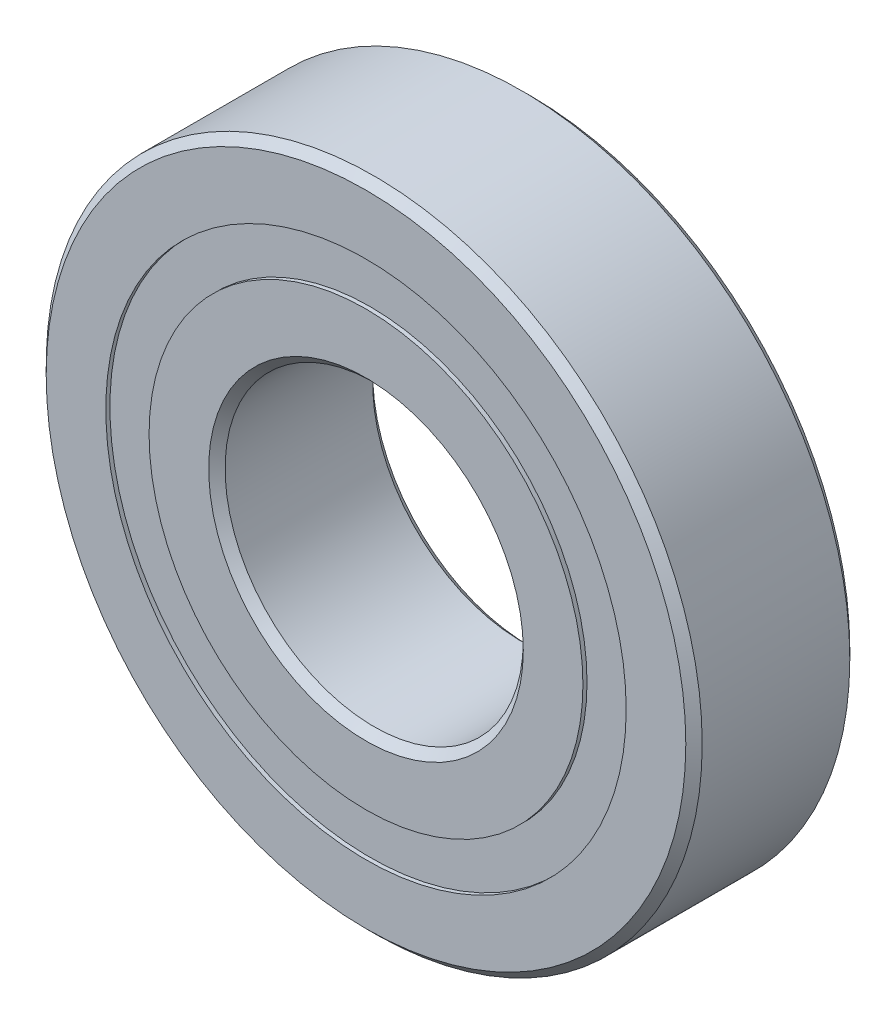
ISO-10303-21;
HEADER;
FILE_DESCRIPTION(('STEP AP214'),'2;1');
FILE_NAME('part.step','',(''),(''),'','','');
FILE_SCHEMA(('AUTOMOTIVE_DESIGN { 1 0 10303 214 1 1 1 1 }'));
ENDSEC;
DATA;
#1=APPLICATION_CONTEXT('core data for automotive mechanical design processes');
#2=APPLICATION_PROTOCOL_DEFINITION('international standard','automotive_design',2000,#1);
#3=PRODUCT_CONTEXT('',#1,'mechanical');
#4=PRODUCT('Part','Part','',(#3));
#5=PRODUCT_RELATED_PRODUCT_CATEGORY('part','',(#4));
#6=PRODUCT_DEFINITION_FORMATION('','',#4);
#7=PRODUCT_DEFINITION_CONTEXT('part definition',#1,'design');
#8=PRODUCT_DEFINITION('design','',#6,#7);
#9=PRODUCT_DEFINITION_SHAPE('','',#8);
#10=(LENGTH_UNIT() NAMED_UNIT(*) SI_UNIT(.MILLI.,.METRE.));
#11=(NAMED_UNIT(*) PLANE_ANGLE_UNIT() SI_UNIT($,.RADIAN.));
#12=(NAMED_UNIT(*) SI_UNIT($,.STERADIAN.) SOLID_ANGLE_UNIT());
#13=UNCERTAINTY_MEASURE_WITH_UNIT(LENGTH_MEASURE(1.E-05),#10,'distance_accuracy_value','');
#14=(GEOMETRIC_REPRESENTATION_CONTEXT(3) GLOBAL_UNCERTAINTY_ASSIGNED_CONTEXT((#13)) GLOBAL_UNIT_ASSIGNED_CONTEXT((#10,
#11,#12)) REPRESENTATION_CONTEXT('',''));
#15=CARTESIAN_POINT('',(0.,0.,0.));
#16=DIRECTION('',(0.,0.,1.));
#17=DIRECTION('',(1.,0.,0.));
#18=AXIS2_PLACEMENT_3D('',#15,#16,#17);
#19=CARTESIAN_POINT('',(0.,13.8513736263736,-4.14734375));
#20=DIRECTION('',(0.,0.,1.));
#21=DIRECTION('',(1.,0.,0.));
#22=AXIS2_PLACEMENT_3D('',#19,#20,#21);
#23=PLANE('',#22);
#24=CARTESIAN_POINT('',(0.,0.,-4.14734375));
#25=DIRECTION('',(0.,0.,1.));
#26=DIRECTION('',(1.,0.,0.));
#27=AXIS2_PLACEMENT_3D('',#24,#25,#26);
#28=CIRCLE('',#27,13.8513736263736);
#29=CARTESIAN_POINT('',(13.8513736263736,0.,-4.14734375));
#30=VERTEX_POINT('',#29);
#31=EDGE_CURVE('E72',#30,#30,#28,.T.);
#32=ORIENTED_EDGE('',*,*,#31,.F.);
#33=EDGE_LOOP('',(#32));
#34=FACE_BOUND('',#33,.T.);
#35=CARTESIAN_POINT('',(0.,0.,-4.14734375));
#36=DIRECTION('',(0.,0.,1.));
#37=DIRECTION('',(1.,0.,0.));
#38=AXIS2_PLACEMENT_3D('',#35,#36,#37);
#39=CIRCLE('',#38,11.5486263736264);
#40=CARTESIAN_POINT('',(11.5486263736264,0.,-4.14734375));
#41=VERTEX_POINT('',#40);
#42=EDGE_CURVE('E11',#41,#41,#39,.T.);
#43=ORIENTED_EDGE('',*,*,#42,.T.);
#44=EDGE_LOOP('',(#43));
#45=FACE_BOUND('',#44,.T.);
#46=ADVANCED_FACE('F58',(#34,#45),#23,.F.);
#47=CARTESIAN_POINT('',(0.,0.,4.365625));
#48=DIRECTION('',(0.,0.,1.));
#49=DIRECTION('',(1.,0.,0.));
#50=AXIS2_PLACEMENT_3D('',#47,#48,#49);
#51=CYLINDRICAL_SURFACE('',#50,11.5486263736264);
#52=ORIENTED_EDGE('',*,*,#42,.F.);
#53=EDGE_LOOP('',(#52));
#54=FACE_BOUND('',#53,.T.);
#55=CARTESIAN_POINT('',(0.,0.,-2.25617798111032));
#56=DIRECTION('',(0.,0.,1.));
#57=DIRECTION('',(1.,0.,0.));
#58=AXIS2_PLACEMENT_3D('',#55,#56,#57);
#59=CIRCLE('',#58,11.5486263736264);
#60=CARTESIAN_POINT('',(11.5486263736264,0.,-2.25617798111032));
#61=VERTEX_POINT('',#60);
#62=EDGE_CURVE('E64',#61,#61,#59,.T.);
#63=ORIENTED_EDGE('',*,*,#62,.T.);
#64=EDGE_LOOP('',(#63));
#65=FACE_BOUND('',#64,.T.);
#66=ADVANCED_FACE('F81',(#54,#65),#51,.F.);
#67=CARTESIAN_POINT('',(0.,13.8513736263736,-2.25617798111032));
#68=DIRECTION('',(0.,0.,-1.));
#69=DIRECTION('',(-1.,0.,0.));
#70=AXIS2_PLACEMENT_3D('',#67,#68,#69);
#71=PLANE('',#70);
#72=ORIENTED_EDGE('',*,*,#62,.F.);
#73=EDGE_LOOP('',(#72));
#74=FACE_BOUND('',#73,.T.);
#75=CARTESIAN_POINT('',(0.,0.,-2.25617798111032));
#76=DIRECTION('',(0.,0.,1.));
#77=DIRECTION('',(1.,0.,0.));
#78=AXIS2_PLACEMENT_3D('',#75,#76,#77);
#79=CIRCLE('',#78,13.8513736263736);
#80=CARTESIAN_POINT('',(13.8513736263736,0.,-2.25617798111032));
#81=VERTEX_POINT('',#80);
#82=EDGE_CURVE('E68',#81,#81,#79,.T.);
#83=ORIENTED_EDGE('',*,*,#82,.T.);
#84=EDGE_LOOP('',(#83));
#85=FACE_BOUND('',#84,.T.);
#86=ADVANCED_FACE('F85',(#74,#85),#71,.F.);
#87=CARTESIAN_POINT('',(0.,0.,4.365625));
#88=DIRECTION('',(0.,0.,1.));
#89=DIRECTION('',(1.,0.,0.));
#90=AXIS2_PLACEMENT_3D('',#87,#88,#89);
#91=CYLINDRICAL_SURFACE('',#90,13.8513736263736);
#92=ORIENTED_EDGE('',*,*,#82,.F.);
#93=EDGE_LOOP('',(#92));
#94=FACE_BOUND('',#93,.T.);
#95=ORIENTED_EDGE('',*,*,#31,.T.);
#96=EDGE_LOOP('',(#95));
#97=FACE_BOUND('',#96,.T.);
#98=ADVANCED_FACE('F78',(#94,#97),#91,.T.);
#99=CLOSED_SHELL('',(#46,#66,#86,#98));
#100=MANIFOLD_SOLID_BREP('B2',#99);
#101=CARTESIAN_POINT('',(0.,13.8513736263736,4.14734375));
#102=DIRECTION('',(0.,0.,-1.));
#103=DIRECTION('',(-1.,0.,0.));
#104=AXIS2_PLACEMENT_3D('',#101,#102,#103);
#105=PLANE('',#104);
#106=CARTESIAN_POINT('',(0.,0.,4.14734375));
#107=DIRECTION('',(0.,0.,1.));
#108=DIRECTION('',(1.,0.,0.));
#109=AXIS2_PLACEMENT_3D('',#106,#107,#108);
#110=CIRCLE('',#109,11.5486263736264);
#111=CARTESIAN_POINT('',(11.5486263736264,0.,4.14734375));
#112=VERTEX_POINT('',#111);
#113=EDGE_CURVE('E57',#112,#112,#110,.T.);
#114=ORIENTED_EDGE('',*,*,#113,.F.);
#115=EDGE_LOOP('',(#114));
#116=FACE_BOUND('',#115,.T.);
#117=CARTESIAN_POINT('',(0.,0.,4.14734375));
#118=DIRECTION('',(0.,0.,1.));
#119=DIRECTION('',(1.,0.,0.));
#120=AXIS2_PLACEMENT_3D('',#117,#118,#119);
#121=CIRCLE('',#120,13.8513736263736);
#122=CARTESIAN_POINT('',(13.8513736263736,0.,4.14734375));
#123=VERTEX_POINT('',#122);
#124=EDGE_CURVE('E148',#123,#123,#121,.T.);
#125=ORIENTED_EDGE('',*,*,#124,.T.);
#126=EDGE_LOOP('',(#125));
#127=FACE_BOUND('',#126,.T.);
#128=ADVANCED_FACE('F134',(#116,#127),#105,.F.);
#129=CARTESIAN_POINT('',(0.,0.,4.365625));
#130=DIRECTION('',(0.,0.,1.));
#131=DIRECTION('',(1.,0.,0.));
#132=AXIS2_PLACEMENT_3D('',#129,#130,#131);
#133=CYLINDRICAL_SURFACE('',#132,11.5486263736264);
#134=CARTESIAN_POINT('',(0.,0.,2.25617798111032));
#135=DIRECTION('',(0.,0.,1.));
#136=DIRECTION('',(1.,0.,0.));
#137=AXIS2_PLACEMENT_3D('',#134,#135,#136);
#138=CIRCLE('',#137,11.5486263736264);
#139=CARTESIAN_POINT('',(11.5486263736264,0.,2.25617798111032));
#140=VERTEX_POINT('',#139);
#141=EDGE_CURVE('E140',#140,#140,#138,.T.);
#142=ORIENTED_EDGE('',*,*,#141,.F.);
#143=EDGE_LOOP('',(#142));
#144=FACE_BOUND('',#143,.T.);
#145=ORIENTED_EDGE('',*,*,#113,.T.);
#146=EDGE_LOOP('',(#145));
#147=FACE_BOUND('',#146,.T.);
#148=ADVANCED_FACE('F163',(#144,#147),#133,.F.);
#149=CARTESIAN_POINT('',(0.,13.8513736263736,2.25617798111032));
#150=DIRECTION('',(0.,0.,1.));
#151=DIRECTION('',(1.,0.,0.));
#152=AXIS2_PLACEMENT_3D('',#149,#150,#151);
#153=PLANE('',#152);
#154=CARTESIAN_POINT('',(0.,0.,2.25617798111032));
#155=DIRECTION('',(0.,0.,1.));
#156=DIRECTION('',(1.,0.,0.));
#157=AXIS2_PLACEMENT_3D('',#154,#155,#156);
#158=CIRCLE('',#157,13.8513736263736);
#159=CARTESIAN_POINT('',(13.8513736263736,0.,2.25617798111032));
#160=VERTEX_POINT('',#159);
#161=EDGE_CURVE('E144',#160,#160,#158,.T.);
#162=ORIENTED_EDGE('',*,*,#161,.F.);
#163=EDGE_LOOP('',(#162));
#164=FACE_BOUND('',#163,.T.);
#165=ORIENTED_EDGE('',*,*,#141,.T.);
#166=EDGE_LOOP('',(#165));
#167=FACE_BOUND('',#166,.T.);
#168=ADVANCED_FACE('F158',(#164,#167),#153,.F.);
#169=CARTESIAN_POINT('',(0.,0.,4.365625));
#170=DIRECTION('',(0.,0.,1.));
#171=DIRECTION('',(1.,0.,0.));
#172=AXIS2_PLACEMENT_3D('',#169,#170,#171);
#173=CYLINDRICAL_SURFACE('',#172,13.8513736263736);
#174=ORIENTED_EDGE('',*,*,#124,.F.);
#175=EDGE_LOOP('',(#174));
#176=FACE_BOUND('',#175,.T.);
#177=ORIENTED_EDGE('',*,*,#161,.T.);
#178=EDGE_LOOP('',(#177));
#179=FACE_BOUND('',#178,.T.);
#180=ADVANCED_FACE('F155',(#176,#179),#173,.T.);
#181=CLOSED_SHELL('',(#128,#148,#168,#180));
#182=MANIFOLD_SOLID_BREP('B6',#181);
#183=CARTESIAN_POINT('',(-7.46487270411427,10.2745158285619,0.));
#184=DIRECTION('',(0.,0.,1.));
#185=DIRECTION('',(-0.587785252292462,0.809016994374955,0.));
#186=AXIS2_PLACEMENT_3D('',#183,#184,#185);
#187=SPHERICAL_SURFACE('',#186,2.25617798111032);
#188=CARTESIAN_POINT('',(-7.46487270411427,10.2745158285619,2.25617798111032));
#189=VERTEX_POINT('',#188);
#190=VERTEX_LOOP('',#189);
#191=FACE_BOUND('',#190,.T.);
#192=ADVANCED_FACE('F210',(#191),#187,.T.);
#193=CLOSED_SHELL('',(#192));
#194=MANIFOLD_SOLID_BREP('B52',#193);
#195=CARTESIAN_POINT('',(-12.0784177569484,3.92451582856197,0.));
#196=DIRECTION('',(0.,0.,1.));
#197=DIRECTION('',(-0.95105651629515,0.309016994374958,0.));
#198=AXIS2_PLACEMENT_3D('',#195,#196,#197);
#199=SPHERICAL_SURFACE('',#198,2.25617798111032);
#200=CARTESIAN_POINT('',(-12.0784177569484,3.92451582856197,2.25617798111032));
#201=VERTEX_POINT('',#200);
#202=VERTEX_LOOP('',#201);
#203=FACE_BOUND('',#202,.T.);
#204=ADVANCED_FACE('F233',(#203),#199,.T.);
#205=CLOSED_SHELL('',(#204));
#206=MANIFOLD_SOLID_BREP('B130',#205);
#207=CARTESIAN_POINT('',(-12.0784177569485,-3.92451582856172,0.));
#208=DIRECTION('',(0.,0.,1.));
#209=DIRECTION('',(-0.951056516295157,-0.309016994374938,0.));
#210=AXIS2_PLACEMENT_3D('',#207,#208,#209);
#211=SPHERICAL_SURFACE('',#210,2.25617798111032);
#212=CARTESIAN_POINT('',(-12.0784177569485,-3.92451582856172,2.25617798111032));
#213=VERTEX_POINT('',#212);
#214=VERTEX_LOOP('',#213);
#215=FACE_BOUND('',#214,.T.);
#216=ADVANCED_FACE('F256',(#215),#211,.T.);
#217=CLOSED_SHELL('',(#216));
#218=MANIFOLD_SOLID_BREP('B206',#217);
#219=CARTESIAN_POINT('',(-7.4648727041145,-10.2745158285618,0.));
#220=DIRECTION('',(0.,0.,1.));
#221=DIRECTION('',(-0.58778525229248,-0.809016994374942,0.));
#222=AXIS2_PLACEMENT_3D('',#219,#220,#221);
#223=SPHERICAL_SURFACE('',#222,2.25617798111032);
#224=CARTESIAN_POINT('',(-7.4648727041145,-10.2745158285618,2.25617798111032));
#225=VERTEX_POINT('',#224);
#226=VERTEX_LOOP('',#225);
#227=FACE_BOUND('',#226,.T.);
#228=ADVANCED_FACE('F279',(#227),#223,.T.);
#229=CLOSED_SHELL('',(#228));
#230=MANIFOLD_SOLID_BREP('B229',#229);
#231=CARTESIAN_POINT('',(0.,-12.7,0.));
#232=DIRECTION('',(0.,0.,1.));
#233=DIRECTION('',(0.,-1.,0.));
#234=AXIS2_PLACEMENT_3D('',#231,#232,#233);
#235=SPHERICAL_SURFACE('',#234,2.25617798111032);
#236=CARTESIAN_POINT('',(0.,-12.7,2.25617798111032));
#237=VERTEX_POINT('',#236);
#238=VERTEX_LOOP('',#237);
#239=FACE_BOUND('',#238,.T.);
#240=ADVANCED_FACE('F302',(#239),#235,.T.);
#241=CLOSED_SHELL('',(#240));
#242=MANIFOLD_SOLID_BREP('B252',#241);
#243=CARTESIAN_POINT('',(7.46487270411435,-10.2745158285619,0.));
#244=DIRECTION('',(0.,0.,1.));
#245=DIRECTION('',(0.587785252292469,-0.809016994374951,0.));
#246=AXIS2_PLACEMENT_3D('',#243,#244,#245);
#247=SPHERICAL_SURFACE('',#246,2.25617798111032);
#248=CARTESIAN_POINT('',(7.46487270411435,-10.2745158285619,2.25617798111032));
#249=VERTEX_POINT('',#248);
#250=VERTEX_LOOP('',#249);
#251=FACE_BOUND('',#250,.T.);
#252=ADVANCED_FACE('F325',(#251),#247,.T.);
#253=CLOSED_SHELL('',(#252));
#254=MANIFOLD_SOLID_BREP('B275',#253);
#255=CARTESIAN_POINT('',(12.0784177569484,-3.92451582856189,0.));
#256=DIRECTION('',(0.,0.,1.));
#257=DIRECTION('',(0.951056516295152,-0.309016994374952,0.));
#258=AXIS2_PLACEMENT_3D('',#255,#256,#257);
#259=SPHERICAL_SURFACE('',#258,2.25617798111032);
#260=CARTESIAN_POINT('',(12.0784177569484,-3.92451582856189,2.25617798111032));
#261=VERTEX_POINT('',#260);
#262=VERTEX_LOOP('',#261);
#263=FACE_BOUND('',#262,.T.);
#264=ADVANCED_FACE('F348',(#263),#259,.T.);
#265=CLOSED_SHELL('',(#264));
#266=MANIFOLD_SOLID_BREP('B298',#265);
#267=CARTESIAN_POINT('',(12.0784177569485,3.9245158285618,0.));
#268=DIRECTION('',(0.,0.,1.));
#269=DIRECTION('',(0.951056516295155,0.309016994374945,0.));
#270=AXIS2_PLACEMENT_3D('',#267,#268,#269);
#271=SPHERICAL_SURFACE('',#270,2.25617798111032);
#272=CARTESIAN_POINT('',(12.0784177569485,3.9245158285618,2.25617798111032));
#273=VERTEX_POINT('',#272);
#274=VERTEX_LOOP('',#273);
#275=FACE_BOUND('',#274,.T.);
#276=ADVANCED_FACE('F371',(#275),#271,.T.);
#277=CLOSED_SHELL('',(#276));
#278=MANIFOLD_SOLID_BREP('B321',#277);
#279=CARTESIAN_POINT('',(7.46487270411442,10.2745158285618,0.));
#280=DIRECTION('',(0.,0.,1.));
#281=DIRECTION('',(0.587785252292474,0.809016994374947,0.));
#282=AXIS2_PLACEMENT_3D('',#279,#280,#281);
#283=SPHERICAL_SURFACE('',#282,2.25617798111032);
#284=CARTESIAN_POINT('',(7.46487270411442,10.2745158285618,2.25617798111032));
#285=VERTEX_POINT('',#284);
#286=VERTEX_LOOP('',#285);
#287=FACE_BOUND('',#286,.T.);
#288=ADVANCED_FACE('F394',(#287),#283,.T.);
#289=CLOSED_SHELL('',(#288));
#290=MANIFOLD_SOLID_BREP('B344',#289);
#291=CARTESIAN_POINT('',(0.,12.7,0.));
#292=DIRECTION('',(0.,0.,1.));
#293=DIRECTION('',(0.,1.,0.));
#294=AXIS2_PLACEMENT_3D('',#291,#292,#293);
#295=SPHERICAL_SURFACE('',#294,2.25617798111032);
#296=CARTESIAN_POINT('',(0.,12.7,2.25617798111032));
#297=VERTEX_POINT('',#296);
#298=VERTEX_LOOP('',#297);
#299=FACE_BOUND('',#298,.T.);
#300=ADVANCED_FACE('F419',(#299),#295,.T.);
#301=CLOSED_SHELL('',(#300));
#302=MANIFOLD_SOLID_BREP('B367',#301);
#303=CARTESIAN_POINT('',(0.,11.5486263736264,4.365625));
#304=DIRECTION('',(0.,0.,-1.));
#305=DIRECTION('',(-1.,0.,0.));
#306=AXIS2_PLACEMENT_3D('',#303,#304,#305);
#307=PLANE('',#306);
#308=CARTESIAN_POINT('',(0.,0.,4.365625));
#309=DIRECTION('',(0.,0.,1.));
#310=DIRECTION('',(1.,0.,0.));
#311=AXIS2_PLACEMENT_3D('',#308,#309,#310);
#312=CIRCLE('',#311,8.3740625);
#313=CARTESIAN_POINT('',(8.3740625,0.,4.365625));
#314=VERTEX_POINT('',#313);
#315=EDGE_CURVE('E465',#314,#314,#312,.T.);
#316=ORIENTED_EDGE('',*,*,#315,.F.);
#317=EDGE_LOOP('',(#316));
#318=FACE_BOUND('',#317,.T.);
#319=CARTESIAN_POINT('',(0.,0.,4.365625));
#320=DIRECTION('',(0.,0.,1.));
#321=DIRECTION('',(1.,0.,0.));
#322=AXIS2_PLACEMENT_3D('',#319,#320,#321);
#323=CIRCLE('',#322,11.5486263736264);
#324=CARTESIAN_POINT('',(11.5486263736264,0.,4.365625));
#325=VERTEX_POINT('',#324);
#326=EDGE_CURVE('E418',#325,#325,#323,.T.);
#327=ORIENTED_EDGE('',*,*,#326,.T.);
#328=EDGE_LOOP('',(#327));
#329=FACE_BOUND('',#328,.T.);
#330=ADVANCED_FACE('F437',(#318,#329),#307,.F.);
#331=CARTESIAN_POINT('',(0.,0.,4.365625));
#332=DIRECTION('',(0.,0.,1.));
#333=DIRECTION('',(1.,0.,0.));
#334=AXIS2_PLACEMENT_3D('',#331,#332,#333);
#335=CYLINDRICAL_SURFACE('',#334,11.5486263736264);
#336=ORIENTED_EDGE('',*,*,#326,.F.);
#337=EDGE_LOOP('',(#336));
#338=FACE_BOUND('',#337,.T.);
#339=CARTESIAN_POINT('',(0.,0.,1.94027777777778));
#340=DIRECTION('',(0.,0.,1.));
#341=DIRECTION('',(1.,0.,0.));
#342=AXIS2_PLACEMENT_3D('',#339,#340,#341);
#343=CIRCLE('',#342,11.5486263736264);
#344=CARTESIAN_POINT('',(11.5486263736264,0.,1.94027777777778));
#345=VERTEX_POINT('',#344);
#346=EDGE_CURVE('E443',#345,#345,#343,.T.);
#347=ORIENTED_EDGE('',*,*,#346,.T.);
#348=EDGE_LOOP('',(#347));
#349=FACE_BOUND('',#348,.T.);
#350=ADVANCED_FACE('F472',(#338,#349),#335,.T.);
#351=CARTESIAN_POINT('',(0.,0.,0.));
#352=DIRECTION('',(0.,0.,1.));
#353=DIRECTION('',(1.,0.,0.));
#354=AXIS2_PLACEMENT_3D('',#351,#352,#353);
#355=TOROIDAL_SURFACE('',#354,12.7,2.25617798111031);
#356=ORIENTED_EDGE('',*,*,#346,.F.);
#357=EDGE_LOOP('',(#356));
#358=FACE_BOUND('',#357,.T.);
#359=CARTESIAN_POINT('',(0.,0.,-1.94027777777778));
#360=DIRECTION('',(0.,0.,1.));
#361=DIRECTION('',(1.,0.,0.));
#362=AXIS2_PLACEMENT_3D('',#359,#360,#361);
#363=CIRCLE('',#362,11.5486263736264);
#364=CARTESIAN_POINT('',(11.5486263736264,0.,-1.94027777777778));
#365=VERTEX_POINT('',#364);
#366=EDGE_CURVE('E447',#365,#365,#363,.T.);
#367=ORIENTED_EDGE('',*,*,#366,.T.);
#368=EDGE_LOOP('',(#367));
#369=FACE_BOUND('',#368,.T.);
#370=ADVANCED_FACE('F476',(#358,#369),#355,.F.);
#371=CARTESIAN_POINT('',(0.,0.,4.365625));
#372=DIRECTION('',(0.,0.,1.));
#373=DIRECTION('',(1.,0.,0.));
#374=AXIS2_PLACEMENT_3D('',#371,#372,#373);
#375=CYLINDRICAL_SURFACE('',#374,11.5486263736264);
#376=ORIENTED_EDGE('',*,*,#366,.F.);
#377=EDGE_LOOP('',(#376));
#378=FACE_BOUND('',#377,.T.);
#379=CARTESIAN_POINT('',(0.,0.,-4.365625));
#380=DIRECTION('',(0.,0.,1.));
#381=DIRECTION('',(1.,0.,0.));
#382=AXIS2_PLACEMENT_3D('',#379,#380,#381);
#383=CIRCLE('',#382,11.5486263736264);
#384=CARTESIAN_POINT('',(11.5486263736264,0.,-4.365625));
#385=VERTEX_POINT('',#384);
#386=EDGE_CURVE('E451',#385,#385,#383,.T.);
#387=ORIENTED_EDGE('',*,*,#386,.T.);
#388=EDGE_LOOP('',(#387));
#389=FACE_BOUND('',#388,.T.);
#390=ADVANCED_FACE('F481',(#378,#389),#375,.T.);
#391=CARTESIAN_POINT('',(0.,8.3740625,-4.365625));
#392=DIRECTION('',(0.,0.,1.));
#393=DIRECTION('',(1.,0.,0.));
#394=AXIS2_PLACEMENT_3D('',#391,#392,#393);
#395=PLANE('',#394);
#396=ORIENTED_EDGE('',*,*,#386,.F.);
#397=EDGE_LOOP('',(#396));
#398=FACE_BOUND('',#397,.T.);
#399=CARTESIAN_POINT('',(0.,0.,-4.365625));
#400=DIRECTION('',(0.,0.,1.));
#401=DIRECTION('',(1.,0.,0.));
#402=AXIS2_PLACEMENT_3D('',#399,#400,#401);
#403=CIRCLE('',#402,8.3740625);
#404=CARTESIAN_POINT('',(8.3740625,0.,-4.365625));
#405=VERTEX_POINT('',#404);
#406=EDGE_CURVE('E456',#405,#405,#403,.T.);
#407=ORIENTED_EDGE('',*,*,#406,.T.);
#408=EDGE_LOOP('',(#407));
#409=FACE_BOUND('',#408,.T.);
#410=ADVANCED_FACE('F487',(#398,#409),#395,.F.);
#411=CARTESIAN_POINT('',(0.,0.,-3.9290625));
#412=DIRECTION('',(0.,0.,-1.));
#413=DIRECTION('',(-1.,0.,0.));
#414=AXIS2_PLACEMENT_3D('',#411,#412,#413);
#415=CONICAL_SURFACE('',#414,7.9375,0.785398163397446);
#416=ORIENTED_EDGE('',*,*,#406,.F.);
#417=EDGE_LOOP('',(#416));
#418=FACE_BOUND('',#417,.T.);
#419=CARTESIAN_POINT('',(0.,0.,-3.9290625));
#420=DIRECTION('',(0.,0.,1.));
#421=DIRECTION('',(1.,0.,0.));
#422=AXIS2_PLACEMENT_3D('',#419,#420,#421);
#423=CIRCLE('',#422,7.9375);
#424=CARTESIAN_POINT('',(7.9375,0.,-3.9290625));
#425=VERTEX_POINT('',#424);
#426=EDGE_CURVE('E459',#425,#425,#423,.T.);
#427=ORIENTED_EDGE('',*,*,#426,.T.);
#428=EDGE_LOOP('',(#427));
#429=FACE_BOUND('',#428,.T.);
#430=ADVANCED_FACE('F491',(#418,#429),#415,.F.);
#431=CARTESIAN_POINT('',(0.,0.,4.365625));
#432=DIRECTION('',(0.,0.,1.));
#433=DIRECTION('',(1.,0.,0.));
#434=AXIS2_PLACEMENT_3D('',#431,#432,#433);
#435=CYLINDRICAL_SURFACE('',#434,7.9375);
#436=ORIENTED_EDGE('',*,*,#426,.F.);
#437=EDGE_LOOP('',(#436));
#438=FACE_BOUND('',#437,.T.);
#439=CARTESIAN_POINT('',(0.,0.,3.9290625));
#440=DIRECTION('',(0.,0.,1.));
#441=DIRECTION('',(1.,0.,0.));
#442=AXIS2_PLACEMENT_3D('',#439,#440,#441);
#443=CIRCLE('',#442,7.9375);
#444=CARTESIAN_POINT('',(7.9375,0.,3.9290625));
#445=VERTEX_POINT('',#444);
#446=EDGE_CURVE('E462',#445,#445,#443,.T.);
#447=ORIENTED_EDGE('',*,*,#446,.T.);
#448=EDGE_LOOP('',(#447));
#449=FACE_BOUND('',#448,.T.);
#450=ADVANCED_FACE('F495',(#438,#449),#435,.F.);
#451=CARTESIAN_POINT('',(0.,0.,4.365625));
#452=DIRECTION('',(0.,0.,1.));
#453=DIRECTION('',(1.,0.,0.));
#454=AXIS2_PLACEMENT_3D('',#451,#452,#453);
#455=CONICAL_SURFACE('',#454,8.3740625,0.785398163397447);
#456=ORIENTED_EDGE('',*,*,#446,.F.);
#457=EDGE_LOOP('',(#456));
#458=FACE_BOUND('',#457,.T.);
#459=ORIENTED_EDGE('',*,*,#315,.T.);
#460=EDGE_LOOP('',(#459));
#461=FACE_BOUND('',#460,.T.);
#462=ADVANCED_FACE('F469',(#458,#461),#455,.F.);
#463=CLOSED_SHELL('',(#330,#350,#370,#390,#410,#430,#450,#462));
#464=MANIFOLD_SOLID_BREP('B390',#463);
#465=CARTESIAN_POINT('',(0.,0.,3.9290625));
#466=DIRECTION('',(0.,0.,-1.));
#467=DIRECTION('',(-1.,0.,0.));
#468=AXIS2_PLACEMENT_3D('',#465,#466,#467);
#469=CONICAL_SURFACE('',#468,17.4625,0.785398163397445);
#470=CARTESIAN_POINT('',(0.,0.,4.365625));
#471=DIRECTION('',(0.,0.,1.));
#472=DIRECTION('',(1.,0.,0.));
#473=AXIS2_PLACEMENT_3D('',#470,#471,#472);
#474=CIRCLE('',#473,17.0259375);
#475=CARTESIAN_POINT('',(17.0259375,0.,4.365625));
#476=VERTEX_POINT('',#475);
#477=EDGE_CURVE('E578',#476,#476,#474,.T.);
#478=ORIENTED_EDGE('',*,*,#477,.F.);
#479=EDGE_LOOP('',(#478));
#480=FACE_BOUND('',#479,.T.);
#481=CARTESIAN_POINT('',(0.,0.,3.9290625));
#482=DIRECTION('',(0.,0.,1.));
#483=DIRECTION('',(1.,0.,0.));
#484=AXIS2_PLACEMENT_3D('',#481,#482,#483);
#485=CIRCLE('',#484,17.4625);
#486=CARTESIAN_POINT('',(17.4625,0.,3.9290625));
#487=VERTEX_POINT('',#486);
#488=EDGE_CURVE('E436',#487,#487,#485,.T.);
#489=ORIENTED_EDGE('',*,*,#488,.T.);
#490=EDGE_LOOP('',(#489));
#491=FACE_BOUND('',#490,.T.);
#492=ADVANCED_FACE('F543',(#480,#491),#469,.T.);
#493=CARTESIAN_POINT('',(0.,0.,4.365625));
#494=DIRECTION('',(0.,0.,1.));
#495=DIRECTION('',(1.,0.,0.));
#496=AXIS2_PLACEMENT_3D('',#493,#494,#495);
#497=CYLINDRICAL_SURFACE('',#496,17.4625);
#498=ORIENTED_EDGE('',*,*,#488,.F.);
#499=EDGE_LOOP('',(#498));
#500=FACE_BOUND('',#499,.T.);
#501=CARTESIAN_POINT('',(0.,0.,-3.9290625));
#502=DIRECTION('',(0.,0.,1.));
#503=DIRECTION('',(1.,0.,0.));
#504=AXIS2_PLACEMENT_3D('',#501,#502,#503);
#505=CIRCLE('',#504,17.4625);
#506=CARTESIAN_POINT('',(17.4625,0.,-3.9290625));
#507=VERTEX_POINT('',#506);
#508=EDGE_CURVE('E550',#507,#507,#505,.T.);
#509=ORIENTED_EDGE('',*,*,#508,.T.);
#510=EDGE_LOOP('',(#509));
#511=FACE_BOUND('',#510,.T.);
#512=ADVANCED_FACE('F586',(#500,#511),#497,.T.);
#513=CARTESIAN_POINT('',(0.,0.,-4.365625));
#514=DIRECTION('',(0.,0.,1.));
#515=DIRECTION('',(1.,0.,0.));
#516=AXIS2_PLACEMENT_3D('',#513,#514,#515);
#517=CONICAL_SURFACE('',#516,17.0259375,0.785398163397446);
#518=ORIENTED_EDGE('',*,*,#508,.F.);
#519=EDGE_LOOP('',(#518));
#520=FACE_BOUND('',#519,.T.);
#521=CARTESIAN_POINT('',(0.,0.,-4.365625));
#522=DIRECTION('',(0.,0.,1.));
#523=DIRECTION('',(1.,0.,0.));
#524=AXIS2_PLACEMENT_3D('',#521,#522,#523);
#525=CIRCLE('',#524,17.0259375);
#526=CARTESIAN_POINT('',(17.0259375,0.,-4.365625));
#527=VERTEX_POINT('',#526);
#528=EDGE_CURVE('E555',#527,#527,#525,.T.);
#529=ORIENTED_EDGE('',*,*,#528,.T.);
#530=EDGE_LOOP('',(#529));
#531=FACE_BOUND('',#530,.T.);
#532=ADVANCED_FACE('F590',(#520,#531),#517,.T.);
#533=CARTESIAN_POINT('',(0.,17.0259375,-4.365625));
#534=DIRECTION('',(0.,0.,1.));
#535=DIRECTION('',(1.,0.,0.));
#536=AXIS2_PLACEMENT_3D('',#533,#534,#535);
#537=PLANE('',#536);
#538=ORIENTED_EDGE('',*,*,#528,.F.);
#539=EDGE_LOOP('',(#538));
#540=FACE_BOUND('',#539,.T.);
#541=CARTESIAN_POINT('',(0.,0.,-4.365625));
#542=DIRECTION('',(0.,0.,1.));
#543=DIRECTION('',(1.,0.,0.));
#544=AXIS2_PLACEMENT_3D('',#541,#542,#543);
#545=CIRCLE('',#544,13.8513736263736);
#546=CARTESIAN_POINT('',(13.8513736263736,0.,-4.365625));
#547=VERTEX_POINT('',#546);
#548=EDGE_CURVE('E560',#547,#547,#545,.T.);
#549=ORIENTED_EDGE('',*,*,#548,.T.);
#550=EDGE_LOOP('',(#549));
#551=FACE_BOUND('',#550,.T.);
#552=ADVANCED_FACE('F595',(#540,#551),#537,.F.);
#553=CARTESIAN_POINT('',(0.,0.,4.365625));
#554=DIRECTION('',(0.,0.,1.));
#555=DIRECTION('',(1.,0.,0.));
#556=AXIS2_PLACEMENT_3D('',#553,#554,#555);
#557=CYLINDRICAL_SURFACE('',#556,13.8513736263736);
#558=ORIENTED_EDGE('',*,*,#548,.F.);
#559=EDGE_LOOP('',(#558));
#560=FACE_BOUND('',#559,.T.);
#561=CARTESIAN_POINT('',(0.,0.,-1.94027777777778));
#562=DIRECTION('',(0.,0.,1.));
#563=DIRECTION('',(1.,0.,0.));
#564=AXIS2_PLACEMENT_3D('',#561,#562,#563);
#565=CIRCLE('',#564,13.8513736263736);
#566=CARTESIAN_POINT('',(13.8513736263736,0.,-1.94027777777778));
#567=VERTEX_POINT('',#566);
#568=EDGE_CURVE('E566',#567,#567,#565,.T.);
#569=ORIENTED_EDGE('',*,*,#568,.T.);
#570=EDGE_LOOP('',(#569));
#571=FACE_BOUND('',#570,.T.);
#572=ADVANCED_FACE('F601',(#560,#571),#557,.F.);
#573=CARTESIAN_POINT('',(0.,0.,0.));
#574=DIRECTION('',(0.,0.,1.));
#575=DIRECTION('',(1.,0.,0.));
#576=AXIS2_PLACEMENT_3D('',#573,#574,#575);
#577=TOROIDAL_SURFACE('',#576,12.7,2.25617798111032);
#578=ORIENTED_EDGE('',*,*,#568,.F.);
#579=EDGE_LOOP('',(#578));
#580=FACE_BOUND('',#579,.T.);
#581=CARTESIAN_POINT('',(0.,0.,1.94027777777778));
#582=DIRECTION('',(0.,0.,1.));
#583=DIRECTION('',(1.,0.,0.));
#584=AXIS2_PLACEMENT_3D('',#581,#582,#583);
#585=CIRCLE('',#584,13.8513736263736);
#586=CARTESIAN_POINT('',(13.8513736263736,0.,1.94027777777778));
#587=VERTEX_POINT('',#586);
#588=EDGE_CURVE('E570',#587,#587,#585,.T.);
#589=ORIENTED_EDGE('',*,*,#588,.T.);
#590=EDGE_LOOP('',(#589));
#591=FACE_BOUND('',#590,.T.);
#592=ADVANCED_FACE('F605',(#580,#591),#577,.F.);
#593=CARTESIAN_POINT('',(0.,0.,4.365625));
#594=DIRECTION('',(0.,0.,1.));
#595=DIRECTION('',(1.,0.,0.));
#596=AXIS2_PLACEMENT_3D('',#593,#594,#595);
#597=CYLINDRICAL_SURFACE('',#596,13.8513736263736);
#598=ORIENTED_EDGE('',*,*,#588,.F.);
#599=EDGE_LOOP('',(#598));
#600=FACE_BOUND('',#599,.T.);
#601=CARTESIAN_POINT('',(0.,0.,4.365625));
#602=DIRECTION('',(0.,0.,1.));
#603=DIRECTION('',(1.,0.,0.));
#604=AXIS2_PLACEMENT_3D('',#601,#602,#603);
#605=CIRCLE('',#604,13.8513736263736);
#606=CARTESIAN_POINT('',(13.8513736263736,0.,4.365625));
#607=VERTEX_POINT('',#606);
#608=EDGE_CURVE('E574',#607,#607,#605,.T.);
#609=ORIENTED_EDGE('',*,*,#608,.T.);
#610=EDGE_LOOP('',(#609));
#611=FACE_BOUND('',#610,.T.);
#612=ADVANCED_FACE('F609',(#600,#611),#597,.F.);
#613=CARTESIAN_POINT('',(0.,17.0259375,4.365625));
#614=DIRECTION('',(0.,0.,-1.));
#615=DIRECTION('',(-1.,0.,0.));
#616=AXIS2_PLACEMENT_3D('',#613,#614,#615);
#617=PLANE('',#616);
#618=ORIENTED_EDGE('',*,*,#608,.F.);
#619=EDGE_LOOP('',(#618));
#620=FACE_BOUND('',#619,.T.);
#621=ORIENTED_EDGE('',*,*,#477,.T.);
#622=EDGE_LOOP('',(#621));
#623=FACE_BOUND('',#622,.T.);
#624=ADVANCED_FACE('F583',(#620,#623),#617,.F.);
#625=CLOSED_SHELL('',(#492,#512,#532,#552,#572,#592,#612,#624));
#626=MANIFOLD_SOLID_BREP('B413',#625);
#627=ADVANCED_BREP_SHAPE_REPRESENTATION('',(#18,#100,#182,#194,#206,#218,#230,#242,#254,#266,
#278,#290,#302,#464,#626),#14);
#628=SHAPE_DEFINITION_REPRESENTATION(#9,#627);
ENDSEC;
END-ISO-10303-21;
